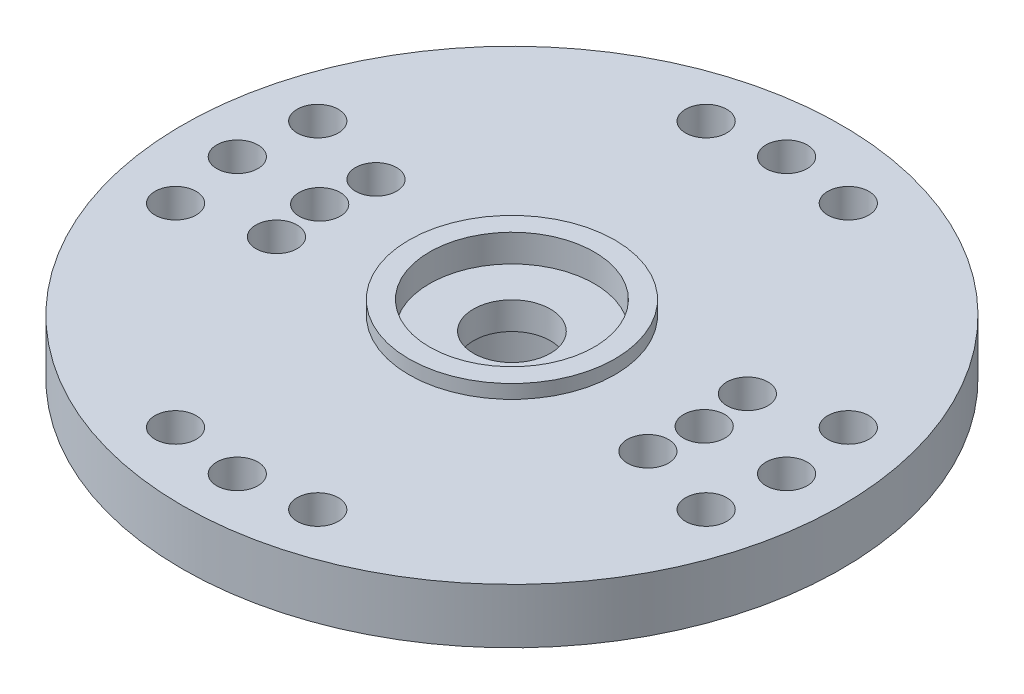
ISO-10303-21;
HEADER;
FILE_DESCRIPTION(('STEP AP214'),'2;1');
FILE_NAME('part.step','',(''),(''),'','','');
FILE_SCHEMA(('AUTOMOTIVE_DESIGN { 1 0 10303 214 1 1 1 1 }'));
ENDSEC;
DATA;
#1=APPLICATION_CONTEXT('core data for automotive mechanical design processes');
#2=APPLICATION_PROTOCOL_DEFINITION('international standard','automotive_design',2000,#1);
#3=PRODUCT_CONTEXT('',#1,'mechanical');
#4=PRODUCT('Part','Part','',(#3));
#5=PRODUCT_RELATED_PRODUCT_CATEGORY('part','',(#4));
#6=PRODUCT_DEFINITION_FORMATION('','',#4);
#7=PRODUCT_DEFINITION_CONTEXT('part definition',#1,'design');
#8=PRODUCT_DEFINITION('design','',#6,#7);
#9=PRODUCT_DEFINITION_SHAPE('','',#8);
#10=(LENGTH_UNIT() NAMED_UNIT(*) SI_UNIT(.MILLI.,.METRE.));
#11=(NAMED_UNIT(*) PLANE_ANGLE_UNIT() SI_UNIT($,.RADIAN.));
#12=(NAMED_UNIT(*) SI_UNIT($,.STERADIAN.) SOLID_ANGLE_UNIT());
#13=UNCERTAINTY_MEASURE_WITH_UNIT(LENGTH_MEASURE(1.E-05),#10,'distance_accuracy_value','');
#14=(GEOMETRIC_REPRESENTATION_CONTEXT(3) GLOBAL_UNCERTAINTY_ASSIGNED_CONTEXT((#13)) GLOBAL_UNIT_ASSIGNED_CONTEXT((#10,
#11,#12)) REPRESENTATION_CONTEXT('',''));
#15=CARTESIAN_POINT('',(0.,0.,0.));
#16=DIRECTION('',(0.,0.,1.));
#17=DIRECTION('',(1.,0.,0.));
#18=AXIS2_PLACEMENT_3D('',#15,#16,#17);
#19=CARTESIAN_POINT('',(0.,0.,0.));
#20=DIRECTION('',(0.,1.,0.));
#21=DIRECTION('',(0.,0.,1.));
#22=AXIS2_PLACEMENT_3D('',#19,#20,#21);
#23=CYLINDRICAL_SURFACE('',#22,1.4);
#24=CARTESIAN_POINT('',(0.,-0.5,0.));
#25=DIRECTION('',(0.,1.,0.));
#26=DIRECTION('',(0.,0.,1.));
#27=AXIS2_PLACEMENT_3D('',#24,#25,#26);
#28=CIRCLE('',#27,1.4);
#29=CARTESIAN_POINT('',(0.,-0.5,1.4));
#30=VERTEX_POINT('',#29);
#31=EDGE_CURVE('E50',#30,#30,#28,.T.);
#32=ORIENTED_EDGE('',*,*,#31,.T.);
#33=EDGE_LOOP('',(#32));
#34=FACE_BOUND('',#33,.T.);
#35=CARTESIAN_POINT('',(0.,-1.5,0.));
#36=DIRECTION('',(0.,-1.,0.));
#37=DIRECTION('',(0.,0.,-1.));
#38=AXIS2_PLACEMENT_3D('',#35,#36,#37);
#39=CIRCLE('',#38,1.4);
#40=CARTESIAN_POINT('',(0.,-1.5,-1.4));
#41=VERTEX_POINT('',#40);
#42=EDGE_CURVE('E38',#41,#41,#39,.T.);
#43=ORIENTED_EDGE('',*,*,#42,.T.);
#44=EDGE_LOOP('',(#43));
#45=FACE_BOUND('',#44,.T.);
#46=ADVANCED_FACE('F34',(#34,#45),#23,.F.);
#47=CARTESIAN_POINT('',(0.,0.,0.));
#48=DIRECTION('',(0.,1.,0.));
#49=DIRECTION('',(0.,0.,1.));
#50=AXIS2_PLACEMENT_3D('',#47,#48,#49);
#51=CYLINDRICAL_SURFACE('',#50,12.);
#52=CARTESIAN_POINT('',(0.,-2.,0.));
#53=DIRECTION('',(0.,1.,0.));
#54=DIRECTION('',(0.,0.,1.));
#55=AXIS2_PLACEMENT_3D('',#52,#53,#54);
#56=CIRCLE('',#55,12.);
#57=CARTESIAN_POINT('',(0.,-2.,12.));
#58=VERTEX_POINT('',#57);
#59=EDGE_CURVE('E10',#58,#58,#56,.T.);
#60=ORIENTED_EDGE('',*,*,#59,.T.);
#61=EDGE_LOOP('',(#60));
#62=FACE_BOUND('',#61,.T.);
#63=CARTESIAN_POINT('',(0.,0.,0.));
#64=DIRECTION('',(0.,1.,0.));
#65=DIRECTION('',(0.,0.,1.));
#66=AXIS2_PLACEMENT_3D('',#63,#64,#65);
#67=CIRCLE('',#66,12.);
#68=CARTESIAN_POINT('',(0.,0.,12.));
#69=VERTEX_POINT('',#68);
#70=EDGE_CURVE('E136',#69,#69,#67,.T.);
#71=ORIENTED_EDGE('',*,*,#70,.F.);
#72=EDGE_LOOP('',(#71));
#73=FACE_BOUND('',#72,.T.);
#74=ADVANCED_FACE('F36',(#62,#73),#51,.T.);
#75=CARTESIAN_POINT('',(-12.,-2.,0.));
#76=DIRECTION('',(0.,-1.,0.));
#77=DIRECTION('',(0.,0.,-1.));
#78=AXIS2_PLACEMENT_3D('',#75,#76,#77);
#79=PLANE('',#78);
#80=CARTESIAN_POINT('',(7.,-2.,0.));
#81=DIRECTION('',(0.,-1.,0.));
#82=DIRECTION('',(0.,0.,1.));
#83=AXIS2_PLACEMENT_3D('',#80,#81,#82);
#84=CIRCLE('',#83,0.749999999999993);
#85=CARTESIAN_POINT('',(7.00000000000001,-2.,0.749999999999944));
#86=VERTEX_POINT('',#85);
#87=EDGE_CURVE('E274',#86,#86,#84,.T.);
#88=ORIENTED_EDGE('',*,*,#87,.F.);
#89=EDGE_LOOP('',(#88));
#90=FACE_BOUND('',#89,.T.);
#91=CARTESIAN_POINT('',(6.76148078402348,-2.,-1.81173331571765));
#92=DIRECTION('',(0.,-1.,0.));
#93=DIRECTION('',(0.,0.,1.));
#94=AXIS2_PLACEMENT_3D('',#91,#92,#93);
#95=CIRCLE('',#94,0.749999999999993);
#96=CARTESIAN_POINT('',(6.76148078402348,-2.,-1.06173331571766));
#97=VERTEX_POINT('',#96);
#98=EDGE_CURVE('E279',#97,#97,#95,.T.);
#99=ORIENTED_EDGE('',*,*,#98,.F.);
#100=EDGE_LOOP('',(#99));
#101=FACE_BOUND('',#100,.T.);
#102=CARTESIAN_POINT('',(6.7614807840235,-2.,1.81173331571755));
#103=DIRECTION('',(0.,-1.,0.));
#104=DIRECTION('',(0.,0.,1.));
#105=AXIS2_PLACEMENT_3D('',#102,#103,#104);
#106=CIRCLE('',#105,0.749999999999993);
#107=CARTESIAN_POINT('',(6.76148078402351,-2.,2.56173331571755));
#108=VERTEX_POINT('',#107);
#109=EDGE_CURVE('E288',#108,#108,#106,.T.);
#110=ORIENTED_EDGE('',*,*,#109,.F.);
#111=EDGE_LOOP('',(#110));
#112=FACE_BOUND('',#111,.T.);
#113=CARTESIAN_POINT('',(-6.76148078402349,-2.,-1.8117333157176));
#114=DIRECTION('',(0.,-1.,0.));
#115=DIRECTION('',(0.,0.,-1.));
#116=AXIS2_PLACEMENT_3D('',#113,#114,#115);
#117=CIRCLE('',#116,0.749999999999993);
#118=CARTESIAN_POINT('',(-6.76148078402349,-2.,-2.56173331571759));
#119=VERTEX_POINT('',#118);
#120=EDGE_CURVE('E294',#119,#119,#117,.T.);
#121=ORIENTED_EDGE('',*,*,#120,.F.);
#122=EDGE_LOOP('',(#121));
#123=FACE_BOUND('',#122,.T.);
#124=CARTESIAN_POINT('',(-7.,-2.,0.));
#125=DIRECTION('',(0.,-1.,0.));
#126=DIRECTION('',(0.,0.,-1.));
#127=AXIS2_PLACEMENT_3D('',#124,#125,#126);
#128=CIRCLE('',#127,0.749999999999993);
#129=CARTESIAN_POINT('',(-7.,-2.,-0.749999999999993));
#130=VERTEX_POINT('',#129);
#131=EDGE_CURVE('E300',#130,#130,#128,.T.);
#132=ORIENTED_EDGE('',*,*,#131,.F.);
#133=EDGE_LOOP('',(#132));
#134=FACE_BOUND('',#133,.T.);
#135=CARTESIAN_POINT('',(-6.76148078402349,-2.,1.8117333157176));
#136=DIRECTION('',(0.,-1.,0.));
#137=DIRECTION('',(0.,0.,-1.));
#138=AXIS2_PLACEMENT_3D('',#135,#136,#137);
#139=CIRCLE('',#138,0.749999999999993);
#140=CARTESIAN_POINT('',(-6.76148078402349,-2.,1.06173331571761));
#141=VERTEX_POINT('',#140);
#142=EDGE_CURVE('E306',#141,#141,#139,.T.);
#143=ORIENTED_EDGE('',*,*,#142,.F.);
#144=EDGE_LOOP('',(#143));
#145=FACE_BOUND('',#144,.T.);
#146=CARTESIAN_POINT('',(-9.65925826289071,-2.,2.58819045102512));
#147=DIRECTION('',(0.,-1.,0.));
#148=DIRECTION('',(-1.,0.,0.));
#149=AXIS2_PLACEMENT_3D('',#146,#147,#148);
#150=CIRCLE('',#149,0.75);
#151=CARTESIAN_POINT('',(-10.4092582628907,-2.,2.58819045102511));
#152=VERTEX_POINT('',#151);
#153=EDGE_CURVE('E57',#152,#152,#150,.T.);
#154=ORIENTED_EDGE('',*,*,#153,.F.);
#155=EDGE_LOOP('',(#154));
#156=FACE_BOUND('',#155,.T.);
#157=CARTESIAN_POINT('',(2.58819045102515,-2.,9.6592582628907));
#158=DIRECTION('',(0.,-1.,0.));
#159=DIRECTION('',(0.,0.,1.));
#160=AXIS2_PLACEMENT_3D('',#157,#158,#159);
#161=CIRCLE('',#160,0.75);
#162=CARTESIAN_POINT('',(2.58819045102514,-2.,10.4092582628907));
#163=VERTEX_POINT('',#162);
#164=EDGE_CURVE('E73',#163,#163,#161,.T.);
#165=ORIENTED_EDGE('',*,*,#164,.F.);
#166=EDGE_LOOP('',(#165));
#167=FACE_BOUND('',#166,.T.);
#168=CARTESIAN_POINT('',(9.65925826289069,-2.,-2.58819045102518));
#169=DIRECTION('',(0.,-1.,0.));
#170=DIRECTION('',(1.,0.,0.));
#171=AXIS2_PLACEMENT_3D('',#168,#169,#170);
#172=CIRCLE('',#171,0.75);
#173=CARTESIAN_POINT('',(10.4092582628907,-2.,-2.58819045102518));
#174=VERTEX_POINT('',#173);
#175=EDGE_CURVE('E79',#174,#174,#172,.T.);
#176=ORIENTED_EDGE('',*,*,#175,.F.);
#177=EDGE_LOOP('',(#176));
#178=FACE_BOUND('',#177,.T.);
#179=CARTESIAN_POINT('',(-9.65925826289065,-2.,-2.58819045102531));
#180=DIRECTION('',(0.,-1.,0.));
#181=DIRECTION('',(-1.,0.,0.));
#182=AXIS2_PLACEMENT_3D('',#179,#180,#181);
#183=CIRCLE('',#182,0.75);
#184=CARTESIAN_POINT('',(-10.4092582628907,-2.,-2.58819045102532));
#185=VERTEX_POINT('',#184);
#186=EDGE_CURVE('E85',#185,#185,#183,.T.);
#187=ORIENTED_EDGE('',*,*,#186,.F.);
#188=EDGE_LOOP('',(#187));
#189=FACE_BOUND('',#188,.T.);
#190=CARTESIAN_POINT('',(-2.58819045102528,-2.,9.65925826289067));
#191=DIRECTION('',(0.,-1.,0.));
#192=DIRECTION('',(0.,0.,1.));
#193=AXIS2_PLACEMENT_3D('',#190,#191,#192);
#194=CIRCLE('',#193,0.75);
#195=CARTESIAN_POINT('',(-2.58819045102529,-2.,10.4092582628907));
#196=VERTEX_POINT('',#195);
#197=EDGE_CURVE('E91',#196,#196,#194,.T.);
#198=ORIENTED_EDGE('',*,*,#197,.F.);
#199=EDGE_LOOP('',(#198));
#200=FACE_BOUND('',#199,.T.);
#201=CARTESIAN_POINT('',(9.65925826289067,-2.,2.58819045102525));
#202=DIRECTION('',(0.,-1.,0.));
#203=DIRECTION('',(1.,0.,0.));
#204=AXIS2_PLACEMENT_3D('',#201,#202,#203);
#205=CIRCLE('',#204,0.75);
#206=CARTESIAN_POINT('',(10.4092582628907,-2.,2.58819045102525));
#207=VERTEX_POINT('',#206);
#208=EDGE_CURVE('E97',#207,#207,#205,.T.);
#209=ORIENTED_EDGE('',*,*,#208,.F.);
#210=EDGE_LOOP('',(#209));
#211=FACE_BOUND('',#210,.T.);
#212=CARTESIAN_POINT('',(-10.,-2.,-1.04744500833281E-13));
#213=DIRECTION('',(0.,-1.,0.));
#214=DIRECTION('',(-1.,0.,0.));
#215=AXIS2_PLACEMENT_3D('',#212,#213,#214);
#216=CIRCLE('',#215,0.75);
#217=CARTESIAN_POINT('',(-10.75,-2.,-1.12600338395778E-13));
#218=VERTEX_POINT('',#217);
#219=EDGE_CURVE('E103',#218,#218,#216,.T.);
#220=ORIENTED_EDGE('',*,*,#219,.F.);
#221=EDGE_LOOP('',(#220));
#222=FACE_BOUND('',#221,.T.);
#223=CARTESIAN_POINT('',(0.,-2.,10.));
#224=DIRECTION('',(0.,-1.,0.));
#225=DIRECTION('',(0.,0.,1.));
#226=AXIS2_PLACEMENT_3D('',#223,#224,#225);
#227=CIRCLE('',#226,0.75);
#228=CARTESIAN_POINT('',(0.,-2.,10.75));
#229=VERTEX_POINT('',#228);
#230=EDGE_CURVE('E109',#229,#229,#227,.T.);
#231=ORIENTED_EDGE('',*,*,#230,.F.);
#232=EDGE_LOOP('',(#231));
#233=FACE_BOUND('',#232,.T.);
#234=CARTESIAN_POINT('',(10.,-2.,0.));
#235=DIRECTION('',(0.,-1.,0.));
#236=DIRECTION('',(1.,0.,0.));
#237=AXIS2_PLACEMENT_3D('',#234,#235,#236);
#238=CIRCLE('',#237,0.75);
#239=CARTESIAN_POINT('',(10.75,-2.,0.));
#240=VERTEX_POINT('',#239);
#241=EDGE_CURVE('E115',#240,#240,#238,.T.);
#242=ORIENTED_EDGE('',*,*,#241,.F.);
#243=EDGE_LOOP('',(#242));
#244=FACE_BOUND('',#243,.T.);
#245=CARTESIAN_POINT('',(0.,-2.,-10.));
#246=DIRECTION('',(0.,-1.,0.));
#247=DIRECTION('',(0.,0.,-1.));
#248=AXIS2_PLACEMENT_3D('',#245,#246,#247);
#249=CIRCLE('',#248,0.75);
#250=CARTESIAN_POINT('',(0.,-2.,-10.75));
#251=VERTEX_POINT('',#250);
#252=EDGE_CURVE('E121',#251,#251,#249,.T.);
#253=ORIENTED_EDGE('',*,*,#252,.F.);
#254=EDGE_LOOP('',(#253));
#255=FACE_BOUND('',#254,.T.);
#256=CARTESIAN_POINT('',(-2.58819045102522,-2.,-9.65925826289068));
#257=DIRECTION('',(0.,-1.,0.));
#258=DIRECTION('',(0.,0.,-1.));
#259=AXIS2_PLACEMENT_3D('',#256,#257,#258);
#260=CIRCLE('',#259,0.75);
#261=CARTESIAN_POINT('',(-2.58819045102522,-2.,-10.4092582628907));
#262=VERTEX_POINT('',#261);
#263=EDGE_CURVE('E127',#262,#262,#260,.T.);
#264=ORIENTED_EDGE('',*,*,#263,.F.);
#265=EDGE_LOOP('',(#264));
#266=FACE_BOUND('',#265,.T.);
#267=CARTESIAN_POINT('',(2.58819045102521,-2.,-9.65925826289068));
#268=DIRECTION('',(0.,-1.,0.));
#269=DIRECTION('',(0.,0.,-1.));
#270=AXIS2_PLACEMENT_3D('',#267,#268,#269);
#271=CIRCLE('',#270,0.75);
#272=CARTESIAN_POINT('',(2.58819045102521,-2.,-10.4092582628907));
#273=VERTEX_POINT('',#272);
#274=EDGE_CURVE('E133',#273,#273,#271,.T.);
#275=ORIENTED_EDGE('',*,*,#274,.F.);
#276=EDGE_LOOP('',(#275));
#277=FACE_BOUND('',#276,.T.);
#278=CARTESIAN_POINT('',(0.,-2.,0.));
#279=DIRECTION('',(0.,1.,0.));
#280=DIRECTION('',(0.,0.,1.));
#281=AXIS2_PLACEMENT_3D('',#278,#279,#280);
#282=CIRCLE('',#281,4.45);
#283=CARTESIAN_POINT('',(0.,-2.,4.45));
#284=VERTEX_POINT('',#283);
#285=EDGE_CURVE('E42',#284,#284,#282,.T.);
#286=ORIENTED_EDGE('',*,*,#285,.T.);
#287=EDGE_LOOP('',(#286));
#288=FACE_BOUND('',#287,.T.);
#289=ORIENTED_EDGE('',*,*,#59,.F.);
#290=EDGE_LOOP('',(#289));
#291=FACE_BOUND('',#290,.T.);
#292=ADVANCED_FACE('F162',(#90,#101,#112,#123,#134,#145,#156,#167,#178,#189,#200,#211,#222,#233,
#244,#255,#266,#277,#288,#291),#79,.T.);
#293=CARTESIAN_POINT('',(0.,0.,0.));
#294=DIRECTION('',(0.,1.,0.));
#295=DIRECTION('',(0.,0.,1.));
#296=AXIS2_PLACEMENT_3D('',#293,#294,#295);
#297=CYLINDRICAL_SURFACE('',#296,4.45);
#298=CARTESIAN_POINT('',(0.,-4.5,0.));
#299=DIRECTION('',(0.,1.,0.));
#300=DIRECTION('',(0.,0.,1.));
#301=AXIS2_PLACEMENT_3D('',#298,#299,#300);
#302=CIRCLE('',#301,4.45);
#303=CARTESIAN_POINT('',(0.,-4.5,4.45));
#304=VERTEX_POINT('',#303);
#305=EDGE_CURVE('E47',#304,#304,#302,.T.);
#306=ORIENTED_EDGE('',*,*,#305,.T.);
#307=EDGE_LOOP('',(#306));
#308=FACE_BOUND('',#307,.T.);
#309=ORIENTED_EDGE('',*,*,#285,.F.);
#310=EDGE_LOOP('',(#309));
#311=FACE_BOUND('',#310,.T.);
#312=ADVANCED_FACE('F147',(#308,#311),#297,.T.);
#313=CARTESIAN_POINT('',(-4.45,-4.5,0.));
#314=DIRECTION('',(0.,-1.,0.));
#315=DIRECTION('',(0.,0.,-1.));
#316=AXIS2_PLACEMENT_3D('',#313,#314,#315);
#317=PLANE('',#316);
#318=CARTESIAN_POINT('',(0.,-4.5,0.));
#319=DIRECTION('',(0.,-1.,0.));
#320=DIRECTION('',(0.,0.,-1.));
#321=AXIS2_PLACEMENT_3D('',#318,#319,#320);
#322=CIRCLE('',#321,3.);
#323=CARTESIAN_POINT('',(0.,-4.5,-3.));
#324=VERTEX_POINT('',#323);
#325=EDGE_CURVE('E309',#324,#324,#322,.T.);
#326=ORIENTED_EDGE('',*,*,#325,.F.);
#327=EDGE_LOOP('',(#326));
#328=FACE_BOUND('',#327,.T.);
#329=ORIENTED_EDGE('',*,*,#305,.F.);
#330=EDGE_LOOP('',(#329));
#331=FACE_BOUND('',#330,.T.);
#332=ADVANCED_FACE('F150',(#328,#331),#317,.T.);
#333=CARTESIAN_POINT('',(-3.75,0.5,0.));
#334=DIRECTION('',(0.,1.,0.));
#335=DIRECTION('',(0.,0.,1.));
#336=AXIS2_PLACEMENT_3D('',#333,#334,#335);
#337=PLANE('',#336);
#338=CARTESIAN_POINT('',(0.,0.5,0.));
#339=DIRECTION('',(0.,1.,0.));
#340=DIRECTION('',(0.,0.,1.));
#341=AXIS2_PLACEMENT_3D('',#338,#339,#340);
#342=CIRCLE('',#341,3.);
#343=CARTESIAN_POINT('',(0.,0.5,3.));
#344=VERTEX_POINT('',#343);
#345=EDGE_CURVE('E60',#344,#344,#342,.T.);
#346=ORIENTED_EDGE('',*,*,#345,.F.);
#347=EDGE_LOOP('',(#346));
#348=FACE_BOUND('',#347,.T.);
#349=CARTESIAN_POINT('',(0.,0.5,0.));
#350=DIRECTION('',(0.,1.,0.));
#351=DIRECTION('',(0.,0.,1.));
#352=AXIS2_PLACEMENT_3D('',#349,#350,#351);
#353=CIRCLE('',#352,3.75);
#354=CARTESIAN_POINT('',(0.,0.5,3.75));
#355=VERTEX_POINT('',#354);
#356=EDGE_CURVE('E142',#355,#355,#353,.T.);
#357=ORIENTED_EDGE('',*,*,#356,.T.);
#358=EDGE_LOOP('',(#357));
#359=FACE_BOUND('',#358,.T.);
#360=ADVANCED_FACE('F152',(#348,#359),#337,.T.);
#361=CARTESIAN_POINT('',(0.,0.,0.));
#362=DIRECTION('',(0.,1.,0.));
#363=DIRECTION('',(0.,0.,1.));
#364=AXIS2_PLACEMENT_3D('',#361,#362,#363);
#365=CYLINDRICAL_SURFACE('',#364,3.75);
#366=CARTESIAN_POINT('',(0.,0.,0.));
#367=DIRECTION('',(0.,1.,0.));
#368=DIRECTION('',(0.,0.,1.));
#369=AXIS2_PLACEMENT_3D('',#366,#367,#368);
#370=CIRCLE('',#369,3.75);
#371=CARTESIAN_POINT('',(0.,0.,3.75));
#372=VERTEX_POINT('',#371);
#373=EDGE_CURVE('E139',#372,#372,#370,.T.);
#374=ORIENTED_EDGE('',*,*,#373,.T.);
#375=EDGE_LOOP('',(#374));
#376=FACE_BOUND('',#375,.T.);
#377=ORIENTED_EDGE('',*,*,#356,.F.);
#378=EDGE_LOOP('',(#377));
#379=FACE_BOUND('',#378,.T.);
#380=ADVANCED_FACE('F159',(#376,#379),#365,.T.);
#381=CARTESIAN_POINT('',(-12.,0.,0.));
#382=DIRECTION('',(0.,1.,0.));
#383=DIRECTION('',(0.,0.,1.));
#384=AXIS2_PLACEMENT_3D('',#381,#382,#383);
#385=PLANE('',#384);
#386=CARTESIAN_POINT('',(7.,0.,0.));
#387=DIRECTION('',(0.,1.,0.));
#388=DIRECTION('',(0.,0.,-1.));
#389=AXIS2_PLACEMENT_3D('',#386,#387,#388);
#390=CIRCLE('',#389,0.749999999999987);
#391=CARTESIAN_POINT('',(6.99999999999999,0.,-0.750000000000036));
#392=VERTEX_POINT('',#391);
#393=EDGE_CURVE('E271',#392,#392,#390,.T.);
#394=ORIENTED_EDGE('',*,*,#393,.F.);
#395=EDGE_LOOP('',(#394));
#396=FACE_BOUND('',#395,.T.);
#397=CARTESIAN_POINT('',(6.76148078402348,0.,-1.81173331571765));
#398=DIRECTION('',(0.,1.,0.));
#399=DIRECTION('',(0.,0.,-1.));
#400=AXIS2_PLACEMENT_3D('',#397,#398,#399);
#401=CIRCLE('',#400,0.749999999999987);
#402=CARTESIAN_POINT('',(6.76148078402347,0.,-2.56173331571764));
#403=VERTEX_POINT('',#402);
#404=EDGE_CURVE('E276',#403,#403,#401,.T.);
#405=ORIENTED_EDGE('',*,*,#404,.F.);
#406=EDGE_LOOP('',(#405));
#407=FACE_BOUND('',#406,.T.);
#408=CARTESIAN_POINT('',(6.7614807840235,0.,1.81173331571755));
#409=DIRECTION('',(0.,1.,0.));
#410=DIRECTION('',(0.,0.,-1.));
#411=AXIS2_PLACEMENT_3D('',#408,#409,#410);
#412=CIRCLE('',#411,0.749999999999987);
#413=CARTESIAN_POINT('',(6.7614807840235,0.,1.06173331571757));
#414=VERTEX_POINT('',#413);
#415=EDGE_CURVE('E285',#414,#414,#412,.T.);
#416=ORIENTED_EDGE('',*,*,#415,.F.);
#417=EDGE_LOOP('',(#416));
#418=FACE_BOUND('',#417,.T.);
#419=CARTESIAN_POINT('',(-6.76148078402349,0.,-1.8117333157176));
#420=DIRECTION('',(0.,1.,0.));
#421=DIRECTION('',(0.,0.,1.));
#422=AXIS2_PLACEMENT_3D('',#419,#420,#421);
#423=CIRCLE('',#422,0.749999999999987);
#424=CARTESIAN_POINT('',(-6.76148078402349,0.,-1.06173331571761));
#425=VERTEX_POINT('',#424);
#426=EDGE_CURVE('E291',#425,#425,#423,.T.);
#427=ORIENTED_EDGE('',*,*,#426,.F.);
#428=EDGE_LOOP('',(#427));
#429=FACE_BOUND('',#428,.T.);
#430=CARTESIAN_POINT('',(-7.,0.,0.));
#431=DIRECTION('',(0.,1.,0.));
#432=DIRECTION('',(0.,0.,1.));
#433=AXIS2_PLACEMENT_3D('',#430,#431,#432);
#434=CIRCLE('',#433,0.749999999999987);
#435=CARTESIAN_POINT('',(-7.,0.,0.749999999999987));
#436=VERTEX_POINT('',#435);
#437=EDGE_CURVE('E297',#436,#436,#434,.T.);
#438=ORIENTED_EDGE('',*,*,#437,.F.);
#439=EDGE_LOOP('',(#438));
#440=FACE_BOUND('',#439,.T.);
#441=CARTESIAN_POINT('',(-6.76148078402349,0.,1.8117333157176));
#442=DIRECTION('',(0.,1.,0.));
#443=DIRECTION('',(0.,0.,1.));
#444=AXIS2_PLACEMENT_3D('',#441,#442,#443);
#445=CIRCLE('',#444,0.749999999999987);
#446=CARTESIAN_POINT('',(-6.76148078402349,0.,2.56173331571759));
#447=VERTEX_POINT('',#446);
#448=EDGE_CURVE('E303',#447,#447,#445,.T.);
#449=ORIENTED_EDGE('',*,*,#448,.F.);
#450=EDGE_LOOP('',(#449));
#451=FACE_BOUND('',#450,.T.);
#452=CARTESIAN_POINT('',(-9.65925826289071,0.,2.58819045102512));
#453=DIRECTION('',(0.,1.,0.));
#454=DIRECTION('',(1.,0.,0.));
#455=AXIS2_PLACEMENT_3D('',#452,#453,#454);
#456=CIRCLE('',#455,0.75);
#457=CARTESIAN_POINT('',(-8.90925826289071,0.,2.58819045102512));
#458=VERTEX_POINT('',#457);
#459=EDGE_CURVE('E52',#458,#458,#456,.T.);
#460=ORIENTED_EDGE('',*,*,#459,.F.);
#461=EDGE_LOOP('',(#460));
#462=FACE_BOUND('',#461,.T.);
#463=CARTESIAN_POINT('',(2.58819045102515,0.,9.6592582628907));
#464=DIRECTION('',(0.,1.,0.));
#465=DIRECTION('',(0.,0.,-1.));
#466=AXIS2_PLACEMENT_3D('',#463,#464,#465);
#467=CIRCLE('',#466,0.75);
#468=CARTESIAN_POINT('',(2.58819045102516,0.,8.9092582628907));
#469=VERTEX_POINT('',#468);
#470=EDGE_CURVE('E70',#469,#469,#467,.T.);
#471=ORIENTED_EDGE('',*,*,#470,.F.);
#472=EDGE_LOOP('',(#471));
#473=FACE_BOUND('',#472,.T.);
#474=CARTESIAN_POINT('',(9.65925826289069,0.,-2.58819045102518));
#475=DIRECTION('',(0.,1.,0.));
#476=DIRECTION('',(-1.,0.,0.));
#477=AXIS2_PLACEMENT_3D('',#474,#475,#476);
#478=CIRCLE('',#477,0.75);
#479=CARTESIAN_POINT('',(8.90925826289069,0.,-2.58819045102519));
#480=VERTEX_POINT('',#479);
#481=EDGE_CURVE('E76',#480,#480,#478,.T.);
#482=ORIENTED_EDGE('',*,*,#481,.F.);
#483=EDGE_LOOP('',(#482));
#484=FACE_BOUND('',#483,.T.);
#485=CARTESIAN_POINT('',(-9.65925826289065,0.,-2.58819045102531));
#486=DIRECTION('',(0.,1.,0.));
#487=DIRECTION('',(1.,0.,0.));
#488=AXIS2_PLACEMENT_3D('',#485,#486,#487);
#489=CIRCLE('',#488,0.75);
#490=CARTESIAN_POINT('',(-8.90925826289065,0.,-2.58819045102531));
#491=VERTEX_POINT('',#490);
#492=EDGE_CURVE('E82',#491,#491,#489,.T.);
#493=ORIENTED_EDGE('',*,*,#492,.F.);
#494=EDGE_LOOP('',(#493));
#495=FACE_BOUND('',#494,.T.);
#496=CARTESIAN_POINT('',(-2.58819045102528,0.,9.65925826289067));
#497=DIRECTION('',(0.,1.,0.));
#498=DIRECTION('',(0.,0.,-1.));
#499=AXIS2_PLACEMENT_3D('',#496,#497,#498);
#500=CIRCLE('',#499,0.75);
#501=CARTESIAN_POINT('',(-2.58819045102527,0.,8.90925826289066));
#502=VERTEX_POINT('',#501);
#503=EDGE_CURVE('E88',#502,#502,#500,.T.);
#504=ORIENTED_EDGE('',*,*,#503,.F.);
#505=EDGE_LOOP('',(#504));
#506=FACE_BOUND('',#505,.T.);
#507=CARTESIAN_POINT('',(9.65925826289067,0.,2.58819045102525));
#508=DIRECTION('',(0.,1.,0.));
#509=DIRECTION('',(-1.,0.,0.));
#510=AXIS2_PLACEMENT_3D('',#507,#508,#509);
#511=CIRCLE('',#510,0.75);
#512=CARTESIAN_POINT('',(8.90925826289067,0.,2.58819045102524));
#513=VERTEX_POINT('',#512);
#514=EDGE_CURVE('E94',#513,#513,#511,.T.);
#515=ORIENTED_EDGE('',*,*,#514,.F.);
#516=EDGE_LOOP('',(#515));
#517=FACE_BOUND('',#516,.T.);
#518=CARTESIAN_POINT('',(-10.,0.,-1.04744500833281E-13));
#519=DIRECTION('',(0.,1.,0.));
#520=DIRECTION('',(1.,0.,0.));
#521=AXIS2_PLACEMENT_3D('',#518,#519,#520);
#522=CIRCLE('',#521,0.75);
#523=CARTESIAN_POINT('',(-9.25,0.,0.));
#524=VERTEX_POINT('',#523);
#525=EDGE_CURVE('E100',#524,#524,#522,.T.);
#526=ORIENTED_EDGE('',*,*,#525,.F.);
#527=EDGE_LOOP('',(#526));
#528=FACE_BOUND('',#527,.T.);
#529=CARTESIAN_POINT('',(0.,0.,10.));
#530=DIRECTION('',(0.,1.,0.));
#531=DIRECTION('',(0.,0.,-1.));
#532=AXIS2_PLACEMENT_3D('',#529,#530,#531);
#533=CIRCLE('',#532,0.75);
#534=CARTESIAN_POINT('',(0.,0.,9.25));
#535=VERTEX_POINT('',#534);
#536=EDGE_CURVE('E106',#535,#535,#533,.T.);
#537=ORIENTED_EDGE('',*,*,#536,.F.);
#538=EDGE_LOOP('',(#537));
#539=FACE_BOUND('',#538,.T.);
#540=CARTESIAN_POINT('',(10.,0.,0.));
#541=DIRECTION('',(0.,1.,0.));
#542=DIRECTION('',(-1.,0.,0.));
#543=AXIS2_PLACEMENT_3D('',#540,#541,#542);
#544=CIRCLE('',#543,0.75);
#545=CARTESIAN_POINT('',(9.25,0.,0.));
#546=VERTEX_POINT('',#545);
#547=EDGE_CURVE('E112',#546,#546,#544,.T.);
#548=ORIENTED_EDGE('',*,*,#547,.F.);
#549=EDGE_LOOP('',(#548));
#550=FACE_BOUND('',#549,.T.);
#551=CARTESIAN_POINT('',(0.,0.,-10.));
#552=DIRECTION('',(0.,1.,0.));
#553=DIRECTION('',(0.,0.,1.));
#554=AXIS2_PLACEMENT_3D('',#551,#552,#553);
#555=CIRCLE('',#554,0.75);
#556=CARTESIAN_POINT('',(0.,0.,-9.25));
#557=VERTEX_POINT('',#556);
#558=EDGE_CURVE('E118',#557,#557,#555,.T.);
#559=ORIENTED_EDGE('',*,*,#558,.F.);
#560=EDGE_LOOP('',(#559));
#561=FACE_BOUND('',#560,.T.);
#562=CARTESIAN_POINT('',(-2.58819045102522,0.,-9.65925826289068));
#563=DIRECTION('',(0.,1.,0.));
#564=DIRECTION('',(0.,0.,1.));
#565=AXIS2_PLACEMENT_3D('',#562,#563,#564);
#566=CIRCLE('',#565,0.75);
#567=CARTESIAN_POINT('',(-2.58819045102522,0.,-8.90925826289068));
#568=VERTEX_POINT('',#567);
#569=EDGE_CURVE('E124',#568,#568,#566,.T.);
#570=ORIENTED_EDGE('',*,*,#569,.F.);
#571=EDGE_LOOP('',(#570));
#572=FACE_BOUND('',#571,.T.);
#573=CARTESIAN_POINT('',(2.58819045102521,0.,-9.65925826289068));
#574=DIRECTION('',(0.,1.,0.));
#575=DIRECTION('',(0.,0.,1.));
#576=AXIS2_PLACEMENT_3D('',#573,#574,#575);
#577=CIRCLE('',#576,0.75);
#578=CARTESIAN_POINT('',(2.58819045102521,0.,-8.90925826289068));
#579=VERTEX_POINT('',#578);
#580=EDGE_CURVE('E130',#579,#579,#577,.T.);
#581=ORIENTED_EDGE('',*,*,#580,.F.);
#582=EDGE_LOOP('',(#581));
#583=FACE_BOUND('',#582,.T.);
#584=ORIENTED_EDGE('',*,*,#70,.T.);
#585=EDGE_LOOP('',(#584));
#586=FACE_BOUND('',#585,.T.);
#587=ORIENTED_EDGE('',*,*,#373,.F.);
#588=EDGE_LOOP('',(#587));
#589=FACE_BOUND('',#588,.T.);
#590=ADVANCED_FACE('F174',(#396,#407,#418,#429,#440,#451,#462,#473,#484,#495,#506,#517,#528,
#539,#550,#561,#572,#583,#586,#589),#385,.T.);
#591=CARTESIAN_POINT('',(2.58819045102521,0.,-9.65925826289068));
#592=DIRECTION('',(0.,1.,0.));
#593=DIRECTION('',(0.,0.,1.));
#594=AXIS2_PLACEMENT_3D('',#591,#592,#593);
#595=CYLINDRICAL_SURFACE('',#594,0.75);
#596=ORIENTED_EDGE('',*,*,#580,.T.);
#597=EDGE_LOOP('',(#596));
#598=FACE_BOUND('',#597,.T.);
#599=ORIENTED_EDGE('',*,*,#274,.T.);
#600=EDGE_LOOP('',(#599));
#601=FACE_BOUND('',#600,.T.);
#602=ADVANCED_FACE('F178',(#598,#601),#595,.F.);
#603=CARTESIAN_POINT('',(-2.58819045102522,0.,-9.65925826289068));
#604=DIRECTION('',(0.,1.,0.));
#605=DIRECTION('',(0.,0.,1.));
#606=AXIS2_PLACEMENT_3D('',#603,#604,#605);
#607=CYLINDRICAL_SURFACE('',#606,0.75);
#608=ORIENTED_EDGE('',*,*,#569,.T.);
#609=EDGE_LOOP('',(#608));
#610=FACE_BOUND('',#609,.T.);
#611=ORIENTED_EDGE('',*,*,#263,.T.);
#612=EDGE_LOOP('',(#611));
#613=FACE_BOUND('',#612,.T.);
#614=ADVANCED_FACE('F182',(#610,#613),#607,.F.);
#615=CARTESIAN_POINT('',(0.,0.,-10.));
#616=DIRECTION('',(0.,1.,0.));
#617=DIRECTION('',(0.,0.,1.));
#618=AXIS2_PLACEMENT_3D('',#615,#616,#617);
#619=CYLINDRICAL_SURFACE('',#618,0.75);
#620=ORIENTED_EDGE('',*,*,#558,.T.);
#621=EDGE_LOOP('',(#620));
#622=FACE_BOUND('',#621,.T.);
#623=ORIENTED_EDGE('',*,*,#252,.T.);
#624=EDGE_LOOP('',(#623));
#625=FACE_BOUND('',#624,.T.);
#626=ADVANCED_FACE('F186',(#622,#625),#619,.F.);
#627=CARTESIAN_POINT('',(10.,0.,0.));
#628=DIRECTION('',(0.,1.,0.));
#629=DIRECTION('',(-1.,0.,0.));
#630=AXIS2_PLACEMENT_3D('',#627,#628,#629);
#631=CYLINDRICAL_SURFACE('',#630,0.75);
#632=ORIENTED_EDGE('',*,*,#547,.T.);
#633=EDGE_LOOP('',(#632));
#634=FACE_BOUND('',#633,.T.);
#635=ORIENTED_EDGE('',*,*,#241,.T.);
#636=EDGE_LOOP('',(#635));
#637=FACE_BOUND('',#636,.T.);
#638=ADVANCED_FACE('F190',(#634,#637),#631,.F.);
#639=CARTESIAN_POINT('',(0.,0.,10.));
#640=DIRECTION('',(0.,1.,0.));
#641=DIRECTION('',(0.,0.,-1.));
#642=AXIS2_PLACEMENT_3D('',#639,#640,#641);
#643=CYLINDRICAL_SURFACE('',#642,0.75);
#644=ORIENTED_EDGE('',*,*,#536,.T.);
#645=EDGE_LOOP('',(#644));
#646=FACE_BOUND('',#645,.T.);
#647=ORIENTED_EDGE('',*,*,#230,.T.);
#648=EDGE_LOOP('',(#647));
#649=FACE_BOUND('',#648,.T.);
#650=ADVANCED_FACE('F194',(#646,#649),#643,.F.);
#651=CARTESIAN_POINT('',(-10.,0.,-1.04744500833281E-13));
#652=DIRECTION('',(0.,1.,0.));
#653=DIRECTION('',(1.,0.,0.));
#654=AXIS2_PLACEMENT_3D('',#651,#652,#653);
#655=CYLINDRICAL_SURFACE('',#654,0.75);
#656=ORIENTED_EDGE('',*,*,#525,.T.);
#657=EDGE_LOOP('',(#656));
#658=FACE_BOUND('',#657,.T.);
#659=ORIENTED_EDGE('',*,*,#219,.T.);
#660=EDGE_LOOP('',(#659));
#661=FACE_BOUND('',#660,.T.);
#662=ADVANCED_FACE('F198',(#658,#661),#655,.F.);
#663=CARTESIAN_POINT('',(9.65925826289067,0.,2.58819045102525));
#664=DIRECTION('',(0.,1.,0.));
#665=DIRECTION('',(-1.,0.,0.));
#666=AXIS2_PLACEMENT_3D('',#663,#664,#665);
#667=CYLINDRICAL_SURFACE('',#666,0.75);
#668=ORIENTED_EDGE('',*,*,#514,.T.);
#669=EDGE_LOOP('',(#668));
#670=FACE_BOUND('',#669,.T.);
#671=ORIENTED_EDGE('',*,*,#208,.T.);
#672=EDGE_LOOP('',(#671));
#673=FACE_BOUND('',#672,.T.);
#674=ADVANCED_FACE('F202',(#670,#673),#667,.F.);
#675=CARTESIAN_POINT('',(-2.58819045102528,0.,9.65925826289067));
#676=DIRECTION('',(0.,1.,0.));
#677=DIRECTION('',(0.,0.,-1.));
#678=AXIS2_PLACEMENT_3D('',#675,#676,#677);
#679=CYLINDRICAL_SURFACE('',#678,0.75);
#680=ORIENTED_EDGE('',*,*,#503,.T.);
#681=EDGE_LOOP('',(#680));
#682=FACE_BOUND('',#681,.T.);
#683=ORIENTED_EDGE('',*,*,#197,.T.);
#684=EDGE_LOOP('',(#683));
#685=FACE_BOUND('',#684,.T.);
#686=ADVANCED_FACE('F206',(#682,#685),#679,.F.);
#687=CARTESIAN_POINT('',(-9.65925826289065,0.,-2.58819045102531));
#688=DIRECTION('',(0.,1.,0.));
#689=DIRECTION('',(1.,0.,0.));
#690=AXIS2_PLACEMENT_3D('',#687,#688,#689);
#691=CYLINDRICAL_SURFACE('',#690,0.75);
#692=ORIENTED_EDGE('',*,*,#492,.T.);
#693=EDGE_LOOP('',(#692));
#694=FACE_BOUND('',#693,.T.);
#695=ORIENTED_EDGE('',*,*,#186,.T.);
#696=EDGE_LOOP('',(#695));
#697=FACE_BOUND('',#696,.T.);
#698=ADVANCED_FACE('F210',(#694,#697),#691,.F.);
#699=CARTESIAN_POINT('',(9.65925826289069,0.,-2.58819045102518));
#700=DIRECTION('',(0.,1.,0.));
#701=DIRECTION('',(-1.,0.,0.));
#702=AXIS2_PLACEMENT_3D('',#699,#700,#701);
#703=CYLINDRICAL_SURFACE('',#702,0.75);
#704=ORIENTED_EDGE('',*,*,#481,.T.);
#705=EDGE_LOOP('',(#704));
#706=FACE_BOUND('',#705,.T.);
#707=ORIENTED_EDGE('',*,*,#175,.T.);
#708=EDGE_LOOP('',(#707));
#709=FACE_BOUND('',#708,.T.);
#710=ADVANCED_FACE('F214',(#706,#709),#703,.F.);
#711=CARTESIAN_POINT('',(2.58819045102515,0.,9.6592582628907));
#712=DIRECTION('',(0.,1.,0.));
#713=DIRECTION('',(0.,0.,-1.));
#714=AXIS2_PLACEMENT_3D('',#711,#712,#713);
#715=CYLINDRICAL_SURFACE('',#714,0.75);
#716=ORIENTED_EDGE('',*,*,#470,.T.);
#717=EDGE_LOOP('',(#716));
#718=FACE_BOUND('',#717,.T.);
#719=ORIENTED_EDGE('',*,*,#164,.T.);
#720=EDGE_LOOP('',(#719));
#721=FACE_BOUND('',#720,.T.);
#722=ADVANCED_FACE('F218',(#718,#721),#715,.F.);
#723=CARTESIAN_POINT('',(-9.65925826289071,0.,2.58819045102512));
#724=DIRECTION('',(0.,1.,0.));
#725=DIRECTION('',(1.,0.,0.));
#726=AXIS2_PLACEMENT_3D('',#723,#724,#725);
#727=CYLINDRICAL_SURFACE('',#726,0.75);
#728=ORIENTED_EDGE('',*,*,#459,.T.);
#729=EDGE_LOOP('',(#728));
#730=FACE_BOUND('',#729,.T.);
#731=ORIENTED_EDGE('',*,*,#153,.T.);
#732=EDGE_LOOP('',(#731));
#733=FACE_BOUND('',#732,.T.);
#734=ADVANCED_FACE('F222',(#730,#733),#727,.F.);
#735=CARTESIAN_POINT('',(0.,-0.5,0.));
#736=DIRECTION('',(0.,1.,0.));
#737=DIRECTION('',(0.,0.,1.));
#738=AXIS2_PLACEMENT_3D('',#735,#736,#737);
#739=CYLINDRICAL_SURFACE('',#738,3.);
#740=CARTESIAN_POINT('',(0.,-0.5,0.));
#741=DIRECTION('',(0.,1.,0.));
#742=DIRECTION('',(0.,0.,1.));
#743=AXIS2_PLACEMENT_3D('',#740,#741,#742);
#744=CIRCLE('',#743,3.);
#745=CARTESIAN_POINT('',(0.,-0.5,3.));
#746=VERTEX_POINT('',#745);
#747=EDGE_CURVE('E53',#746,#746,#744,.T.);
#748=ORIENTED_EDGE('',*,*,#747,.F.);
#749=EDGE_LOOP('',(#748));
#750=FACE_BOUND('',#749,.T.);
#751=ORIENTED_EDGE('',*,*,#345,.T.);
#752=EDGE_LOOP('',(#751));
#753=FACE_BOUND('',#752,.T.);
#754=ADVANCED_FACE('F226',(#750,#753),#739,.F.);
#755=CARTESIAN_POINT('',(0.,-0.5,0.));
#756=DIRECTION('',(0.,1.,0.));
#757=DIRECTION('',(0.,0.,1.));
#758=AXIS2_PLACEMENT_3D('',#755,#756,#757);
#759=PLANE('',#758);
#760=ORIENTED_EDGE('',*,*,#31,.F.);
#761=EDGE_LOOP('',(#760));
#762=FACE_BOUND('',#761,.T.);
#763=ORIENTED_EDGE('',*,*,#747,.T.);
#764=EDGE_LOOP('',(#763));
#765=FACE_BOUND('',#764,.T.);
#766=ADVANCED_FACE('F230',(#762,#765),#759,.T.);
#767=CARTESIAN_POINT('',(0.,-1.5,0.));
#768=DIRECTION('',(0.,-1.,0.));
#769=DIRECTION('',(0.,0.,-1.));
#770=AXIS2_PLACEMENT_3D('',#767,#768,#769);
#771=CYLINDRICAL_SURFACE('',#770,3.);
#772=CARTESIAN_POINT('',(0.,-1.5,0.));
#773=DIRECTION('',(0.,-1.,0.));
#774=DIRECTION('',(0.,0.,-1.));
#775=AXIS2_PLACEMENT_3D('',#772,#773,#774);
#776=CIRCLE('',#775,3.);
#777=CARTESIAN_POINT('',(0.,-1.5,-3.));
#778=VERTEX_POINT('',#777);
#779=EDGE_CURVE('E311',#778,#778,#776,.T.);
#780=ORIENTED_EDGE('',*,*,#779,.F.);
#781=EDGE_LOOP('',(#780));
#782=FACE_BOUND('',#781,.T.);
#783=ORIENTED_EDGE('',*,*,#325,.T.);
#784=EDGE_LOOP('',(#783));
#785=FACE_BOUND('',#784,.T.);
#786=ADVANCED_FACE('F234',(#782,#785),#771,.F.);
#787=CARTESIAN_POINT('',(0.,-1.5,0.));
#788=DIRECTION('',(0.,-1.,0.));
#789=DIRECTION('',(0.,0.,-1.));
#790=AXIS2_PLACEMENT_3D('',#787,#788,#789);
#791=PLANE('',#790);
#792=ORIENTED_EDGE('',*,*,#42,.F.);
#793=EDGE_LOOP('',(#792));
#794=FACE_BOUND('',#793,.T.);
#795=ORIENTED_EDGE('',*,*,#779,.T.);
#796=EDGE_LOOP('',(#795));
#797=FACE_BOUND('',#796,.T.);
#798=ADVANCED_FACE('F238',(#794,#797),#791,.T.);
#799=CARTESIAN_POINT('',(-6.76148078402349,0.,1.8117333157176));
#800=DIRECTION('',(0.,1.,0.));
#801=DIRECTION('',(0.,0.,1.));
#802=AXIS2_PLACEMENT_3D('',#799,#800,#801);
#803=CYLINDRICAL_SURFACE('',#802,0.749999999999993);
#804=ORIENTED_EDGE('',*,*,#448,.T.);
#805=EDGE_LOOP('',(#804));
#806=FACE_BOUND('',#805,.T.);
#807=ORIENTED_EDGE('',*,*,#142,.T.);
#808=EDGE_LOOP('',(#807));
#809=FACE_BOUND('',#808,.T.);
#810=ADVANCED_FACE('F242',(#806,#809),#803,.F.);
#811=CARTESIAN_POINT('',(-7.,0.,0.));
#812=DIRECTION('',(0.,1.,0.));
#813=DIRECTION('',(0.,0.,1.));
#814=AXIS2_PLACEMENT_3D('',#811,#812,#813);
#815=CYLINDRICAL_SURFACE('',#814,0.749999999999993);
#816=ORIENTED_EDGE('',*,*,#437,.T.);
#817=EDGE_LOOP('',(#816));
#818=FACE_BOUND('',#817,.T.);
#819=ORIENTED_EDGE('',*,*,#131,.T.);
#820=EDGE_LOOP('',(#819));
#821=FACE_BOUND('',#820,.T.);
#822=ADVANCED_FACE('F246',(#818,#821),#815,.F.);
#823=CARTESIAN_POINT('',(-6.76148078402349,0.,-1.8117333157176));
#824=DIRECTION('',(0.,1.,0.));
#825=DIRECTION('',(0.,0.,1.));
#826=AXIS2_PLACEMENT_3D('',#823,#824,#825);
#827=CYLINDRICAL_SURFACE('',#826,0.749999999999993);
#828=ORIENTED_EDGE('',*,*,#426,.T.);
#829=EDGE_LOOP('',(#828));
#830=FACE_BOUND('',#829,.T.);
#831=ORIENTED_EDGE('',*,*,#120,.T.);
#832=EDGE_LOOP('',(#831));
#833=FACE_BOUND('',#832,.T.);
#834=ADVANCED_FACE('F250',(#830,#833),#827,.F.);
#835=CARTESIAN_POINT('',(6.7614807840235,0.,1.81173331571755));
#836=DIRECTION('',(0.,1.,0.));
#837=DIRECTION('',(0.,0.,-1.));
#838=AXIS2_PLACEMENT_3D('',#835,#836,#837);
#839=CYLINDRICAL_SURFACE('',#838,0.749999999999993);
#840=ORIENTED_EDGE('',*,*,#415,.T.);
#841=EDGE_LOOP('',(#840));
#842=FACE_BOUND('',#841,.T.);
#843=ORIENTED_EDGE('',*,*,#109,.T.);
#844=EDGE_LOOP('',(#843));
#845=FACE_BOUND('',#844,.T.);
#846=ADVANCED_FACE('F254',(#842,#845),#839,.F.);
#847=CARTESIAN_POINT('',(6.76148078402348,0.,-1.81173331571765));
#848=DIRECTION('',(0.,1.,0.));
#849=DIRECTION('',(0.,0.,-1.));
#850=AXIS2_PLACEMENT_3D('',#847,#848,#849);
#851=CYLINDRICAL_SURFACE('',#850,0.749999999999993);
#852=ORIENTED_EDGE('',*,*,#404,.T.);
#853=EDGE_LOOP('',(#852));
#854=FACE_BOUND('',#853,.T.);
#855=ORIENTED_EDGE('',*,*,#98,.T.);
#856=EDGE_LOOP('',(#855));
#857=FACE_BOUND('',#856,.T.);
#858=ADVANCED_FACE('F258',(#854,#857),#851,.F.);
#859=CARTESIAN_POINT('',(7.,0.,0.));
#860=DIRECTION('',(0.,1.,0.));
#861=DIRECTION('',(0.,0.,-1.));
#862=AXIS2_PLACEMENT_3D('',#859,#860,#861);
#863=CYLINDRICAL_SURFACE('',#862,0.749999999999993);
#864=ORIENTED_EDGE('',*,*,#393,.T.);
#865=EDGE_LOOP('',(#864));
#866=FACE_BOUND('',#865,.T.);
#867=ORIENTED_EDGE('',*,*,#87,.T.);
#868=EDGE_LOOP('',(#867));
#869=FACE_BOUND('',#868,.T.);
#870=ADVANCED_FACE('F262',(#866,#869),#863,.F.);
#871=CLOSED_SHELL('',(#46,#74,#292,#312,#332,#360,#380,#590,#602,#614,#626,#638,#650,#662,#674,
#686,#698,#710,#722,#734,#754,#766,#786,#798,#810,#822,#834,#846,#858,#870));
#872=MANIFOLD_SOLID_BREP('B2',#871);
#873=ADVANCED_BREP_SHAPE_REPRESENTATION('',(#18,#872),#14);
#874=SHAPE_DEFINITION_REPRESENTATION(#9,#873);
ENDSEC;
END-ISO-10303-21;
